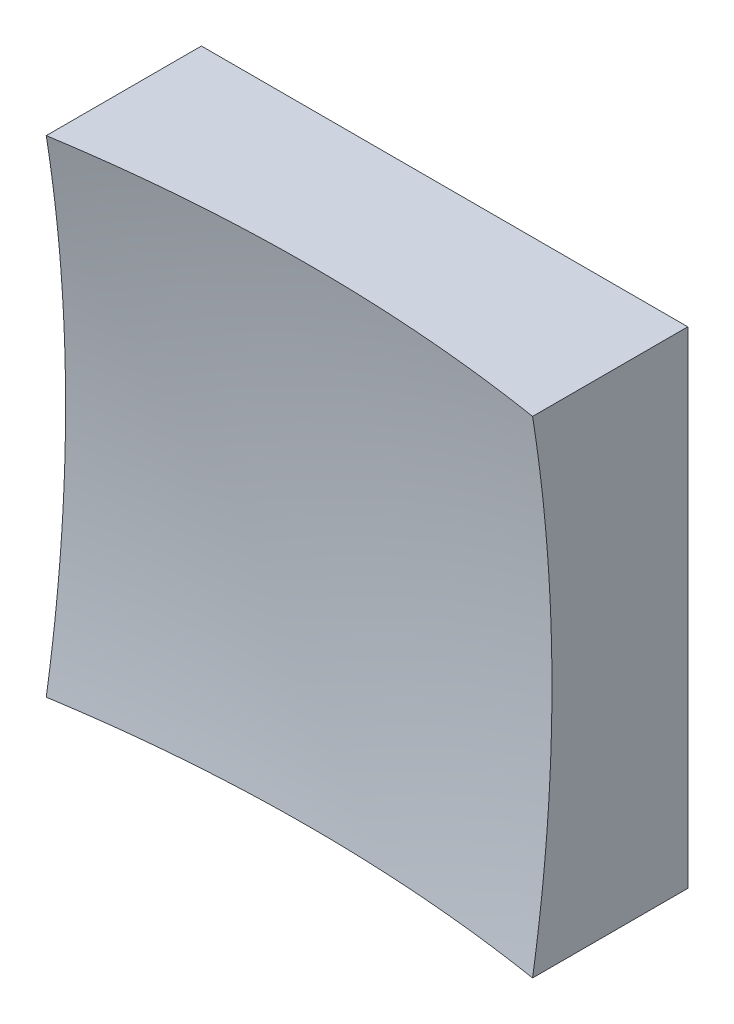
ISO-10303-21;
HEADER;
FILE_DESCRIPTION(('STEP AP214'),'2;1');
FILE_NAME('part.step','',(''),(''),'','','');
FILE_SCHEMA(('AUTOMOTIVE_DESIGN { 1 0 10303 214 1 1 1 1 }'));
ENDSEC;
DATA;
#1=APPLICATION_CONTEXT('core data for automotive mechanical design processes');
#2=APPLICATION_PROTOCOL_DEFINITION('international standard','automotive_design',2000,#1);
#3=PRODUCT_CONTEXT('',#1,'mechanical');
#4=PRODUCT('Part','Part','',(#3));
#5=PRODUCT_RELATED_PRODUCT_CATEGORY('part','',(#4));
#6=PRODUCT_DEFINITION_FORMATION('','',#4);
#7=PRODUCT_DEFINITION_CONTEXT('part definition',#1,'design');
#8=PRODUCT_DEFINITION('design','',#6,#7);
#9=PRODUCT_DEFINITION_SHAPE('','',#8);
#10=(LENGTH_UNIT() NAMED_UNIT(*) SI_UNIT(.MILLI.,.METRE.));
#11=(NAMED_UNIT(*) PLANE_ANGLE_UNIT() SI_UNIT($,.RADIAN.));
#12=(NAMED_UNIT(*) SI_UNIT($,.STERADIAN.) SOLID_ANGLE_UNIT());
#13=UNCERTAINTY_MEASURE_WITH_UNIT(LENGTH_MEASURE(1.E-05),#10,'distance_accuracy_value','');
#14=(GEOMETRIC_REPRESENTATION_CONTEXT(3) GLOBAL_UNCERTAINTY_ASSIGNED_CONTEXT((#13)) GLOBAL_UNIT_ASSIGNED_CONTEXT((#10,
#11,#12)) REPRESENTATION_CONTEXT('',''));
#15=CARTESIAN_POINT('',(0.,0.,0.));
#16=DIRECTION('',(0.,0.,1.));
#17=DIRECTION('',(1.,0.,0.));
#18=AXIS2_PLACEMENT_3D('',#15,#16,#17);
#19=CARTESIAN_POINT('',(-12.5,12.5,20.));
#20=DIRECTION('',(0.,1.,0.));
#21=DIRECTION('',(0.,0.,1.));
#22=AXIS2_PLACEMENT_3D('',#19,#20,#21);
#23=PLANE('',#22);
#24=CARTESIAN_POINT('',(0.,12.5,86.));
#25=DIRECTION('',(0.,1.,0.));
#26=DIRECTION('',(0.,0.,1.));
#27=AXIS2_PLACEMENT_3D('',#24,#25,#26);
#28=CIRCLE('',#27,79.0174031463956);
#29=CARTESIAN_POINT('',(12.5,12.5,7.97756732836381));
#30=VERTEX_POINT('',#29);
#31=CARTESIAN_POINT('',(-12.5,12.5,7.97756732836381));
#32=VERTEX_POINT('',#31);
#33=EDGE_CURVE('E79',#30,#32,#28,.T.);
#34=ORIENTED_EDGE('',*,*,#33,.F.);
#35=DIRECTION('',(0.,0.,-1.));
#36=VECTOR('',#35,1.);
#37=CARTESIAN_POINT('',(12.5,12.5,20.));
#38=LINE('',#37,#36);
#39=CARTESIAN_POINT('',(12.5,12.5,0.));
#40=VERTEX_POINT('',#39);
#41=EDGE_CURVE('E85',#30,#40,#38,.T.);
#42=ORIENTED_EDGE('',*,*,#41,.T.);
#43=DIRECTION('',(1.,0.,0.));
#44=VECTOR('',#43,1.);
#45=CARTESIAN_POINT('',(-12.5,12.5,0.));
#46=LINE('',#45,#44);
#47=CARTESIAN_POINT('',(-12.5,12.5,0.));
#48=VERTEX_POINT('',#47);
#49=EDGE_CURVE('E88',#48,#40,#46,.T.);
#50=ORIENTED_EDGE('',*,*,#49,.F.);
#51=DIRECTION('',(0.,0.,-1.));
#52=VECTOR('',#51,1.);
#53=CARTESIAN_POINT('',(-12.5,12.5,20.));
#54=LINE('',#53,#52);
#55=EDGE_CURVE('E47',#32,#48,#54,.T.);
#56=ORIENTED_EDGE('',*,*,#55,.F.);
#57=EDGE_LOOP('',(#34,#42,#50,#56));
#58=FACE_BOUND('',#57,.T.);
#59=ADVANCED_FACE('F39',(#58),#23,.T.);
#60=CARTESIAN_POINT('',(-12.5,12.5,20.));
#61=DIRECTION('',(1.,0.,0.));
#62=DIRECTION('',(0.,1.,0.));
#63=AXIS2_PLACEMENT_3D('',#60,#61,#62);
#64=PLANE('',#63);
#65=DIRECTION('',(0.,0.,-1.));
#66=VECTOR('',#65,1.);
#67=CARTESIAN_POINT('',(-12.5,-12.5,20.));
#68=LINE('',#67,#66);
#69=CARTESIAN_POINT('',(-12.5,-12.5,7.97756732836381));
#70=VERTEX_POINT('',#69);
#71=CARTESIAN_POINT('',(-12.5,-12.5,0.));
#72=VERTEX_POINT('',#71);
#73=EDGE_CURVE('E100',#70,#72,#68,.T.);
#74=ORIENTED_EDGE('',*,*,#73,.F.);
#75=CARTESIAN_POINT('',(-12.5,0.,86.));
#76=DIRECTION('',(1.,0.,0.));
#77=DIRECTION('',(0.,1.,0.));
#78=AXIS2_PLACEMENT_3D('',#75,#76,#77);
#79=CIRCLE('',#78,79.0174031463956);
#80=EDGE_CURVE('E89',#70,#32,#79,.T.);
#81=ORIENTED_EDGE('',*,*,#80,.T.);
#82=ORIENTED_EDGE('',*,*,#55,.T.);
#83=DIRECTION('',(0.,-1.,0.));
#84=VECTOR('',#83,1.);
#85=CARTESIAN_POINT('',(-12.5,12.5,0.));
#86=LINE('',#85,#84);
#87=EDGE_CURVE('E97',#48,#72,#86,.T.);
#88=ORIENTED_EDGE('',*,*,#87,.T.);
#89=EDGE_LOOP('',(#74,#81,#82,#88));
#90=FACE_BOUND('',#89,.T.);
#91=ADVANCED_FACE('F122',(#90),#64,.F.);
#92=CARTESIAN_POINT('',(-12.5,-12.5,20.));
#93=DIRECTION('',(0.,1.,0.));
#94=DIRECTION('',(0.,0.,1.));
#95=AXIS2_PLACEMENT_3D('',#92,#93,#94);
#96=PLANE('',#95);
#97=DIRECTION('',(0.,0.,-1.));
#98=VECTOR('',#97,1.);
#99=CARTESIAN_POINT('',(12.5,-12.5,20.));
#100=LINE('',#99,#98);
#101=CARTESIAN_POINT('',(12.5,-12.5,7.97756732836381));
#102=VERTEX_POINT('',#101);
#103=CARTESIAN_POINT('',(12.5,-12.5,0.));
#104=VERTEX_POINT('',#103);
#105=EDGE_CURVE('E96',#102,#104,#100,.T.);
#106=ORIENTED_EDGE('',*,*,#105,.F.);
#107=CARTESIAN_POINT('',(0.,-12.5,86.));
#108=DIRECTION('',(0.,1.,0.));
#109=DIRECTION('',(0.,0.,1.));
#110=AXIS2_PLACEMENT_3D('',#107,#108,#109);
#111=CIRCLE('',#110,79.0174031463956);
#112=EDGE_CURVE('E53',#102,#70,#111,.T.);
#113=ORIENTED_EDGE('',*,*,#112,.T.);
#114=ORIENTED_EDGE('',*,*,#73,.T.);
#115=DIRECTION('',(1.,0.,0.));
#116=VECTOR('',#115,1.);
#117=CARTESIAN_POINT('',(-12.5,-12.5,0.));
#118=LINE('',#117,#116);
#119=EDGE_CURVE('E102',#72,#104,#118,.T.);
#120=ORIENTED_EDGE('',*,*,#119,.T.);
#121=EDGE_LOOP('',(#106,#113,#114,#120));
#122=FACE_BOUND('',#121,.T.);
#123=ADVANCED_FACE('F121',(#122),#96,.F.);
#124=CARTESIAN_POINT('',(12.5,12.5,20.));
#125=DIRECTION('',(1.,0.,0.));
#126=DIRECTION('',(0.,1.,0.));
#127=AXIS2_PLACEMENT_3D('',#124,#125,#126);
#128=PLANE('',#127);
#129=CARTESIAN_POINT('',(12.5,0.,86.));
#130=DIRECTION('',(1.,0.,0.));
#131=DIRECTION('',(0.,1.,0.));
#132=AXIS2_PLACEMENT_3D('',#129,#130,#131);
#133=CIRCLE('',#132,79.0174031463956);
#134=EDGE_CURVE('E11',#102,#30,#133,.T.);
#135=ORIENTED_EDGE('',*,*,#134,.F.);
#136=ORIENTED_EDGE('',*,*,#105,.T.);
#137=DIRECTION('',(0.,-1.,0.));
#138=VECTOR('',#137,1.);
#139=CARTESIAN_POINT('',(12.5,12.5,0.));
#140=LINE('',#139,#138);
#141=EDGE_CURVE('E93',#40,#104,#140,.T.);
#142=ORIENTED_EDGE('',*,*,#141,.F.);
#143=ORIENTED_EDGE('',*,*,#41,.F.);
#144=EDGE_LOOP('',(#135,#136,#142,#143));
#145=FACE_BOUND('',#144,.T.);
#146=ADVANCED_FACE('F91',(#145),#128,.T.);
#147=CARTESIAN_POINT('',(0.,0.,0.));
#148=DIRECTION('',(0.,0.,-1.));
#149=DIRECTION('',(-1.,0.,0.));
#150=AXIS2_PLACEMENT_3D('',#147,#148,#149);
#151=PLANE('',#150);
#152=ORIENTED_EDGE('',*,*,#49,.T.);
#153=ORIENTED_EDGE('',*,*,#141,.T.);
#154=ORIENTED_EDGE('',*,*,#119,.F.);
#155=ORIENTED_EDGE('',*,*,#87,.F.);
#156=EDGE_LOOP('',(#152,#153,#154,#155));
#157=FACE_BOUND('',#156,.T.);
#158=ADVANCED_FACE('F125',(#157),#151,.T.);
#159=CARTESIAN_POINT('',(0.,0.,86.));
#160=DIRECTION('',(0.,0.,1.));
#161=DIRECTION('',(1.,0.,0.));
#162=AXIS2_PLACEMENT_3D('',#159,#160,#161);
#163=SPHERICAL_SURFACE('',#162,80.);
#164=ORIENTED_EDGE('',*,*,#33,.T.);
#165=ORIENTED_EDGE('',*,*,#80,.F.);
#166=ORIENTED_EDGE('',*,*,#112,.F.);
#167=ORIENTED_EDGE('',*,*,#134,.T.);
#168=EDGE_LOOP('',(#164,#165,#166,#167));
#169=FACE_BOUND('',#168,.T.);
#170=ADVANCED_FACE('F78',(#169),#163,.F.);
#171=CLOSED_SHELL('',(#59,#91,#123,#146,#158,#170));
#172=MANIFOLD_SOLID_BREP('B2',#171);
#173=ADVANCED_BREP_SHAPE_REPRESENTATION('',(#18,#172),#14);
#174=SHAPE_DEFINITION_REPRESENTATION(#9,#173);
ENDSEC;
END-ISO-10303-21;
